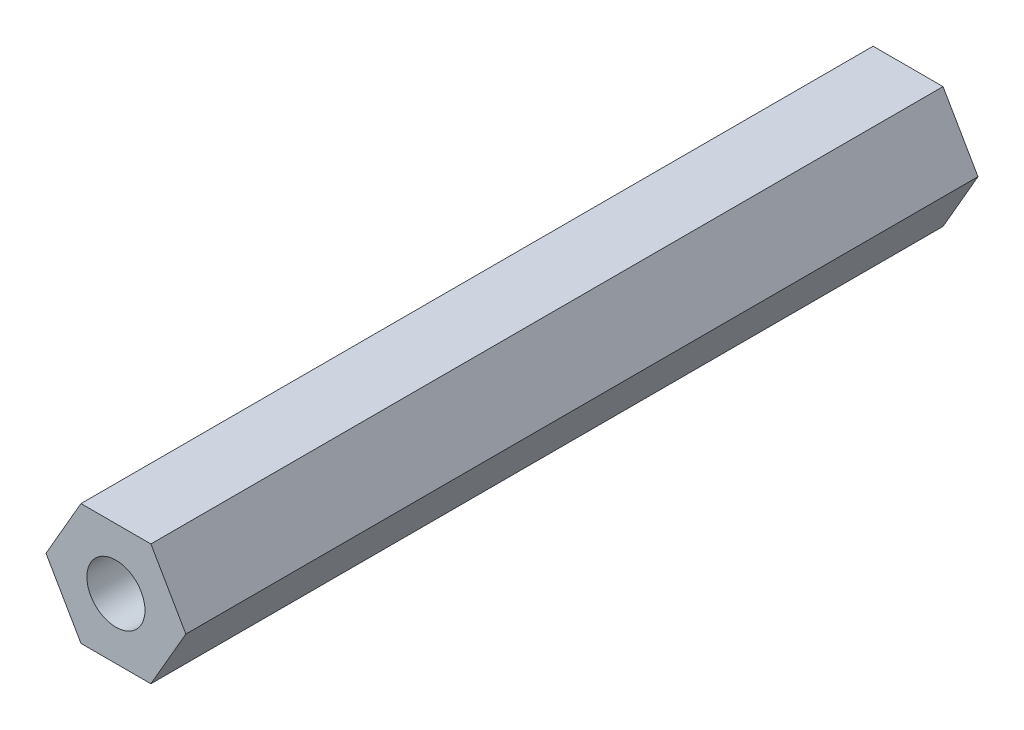
ISO-10303-21;
HEADER;
FILE_DESCRIPTION(('STEP AP214'),'2;1');
FILE_NAME('part.step','',(''),(''),'','','');
FILE_SCHEMA(('AUTOMOTIVE_DESIGN { 1 0 10303 214 1 1 1 1 }'));
ENDSEC;
DATA;
#1=APPLICATION_CONTEXT('core data for automotive mechanical design processes');
#2=APPLICATION_PROTOCOL_DEFINITION('international standard','automotive_design',2000,#1);
#3=PRODUCT_CONTEXT('',#1,'mechanical');
#4=PRODUCT('Part','Part','',(#3));
#5=PRODUCT_RELATED_PRODUCT_CATEGORY('part','',(#4));
#6=PRODUCT_DEFINITION_FORMATION('','',#4);
#7=PRODUCT_DEFINITION_CONTEXT('part definition',#1,'design');
#8=PRODUCT_DEFINITION('design','',#6,#7);
#9=PRODUCT_DEFINITION_SHAPE('','',#8);
#10=(LENGTH_UNIT() NAMED_UNIT(*) SI_UNIT(.MILLI.,.METRE.));
#11=(NAMED_UNIT(*) PLANE_ANGLE_UNIT() SI_UNIT($,.RADIAN.));
#12=(NAMED_UNIT(*) SI_UNIT($,.STERADIAN.) SOLID_ANGLE_UNIT());
#13=UNCERTAINTY_MEASURE_WITH_UNIT(LENGTH_MEASURE(1.E-05),#10,'distance_accuracy_value','');
#14=(GEOMETRIC_REPRESENTATION_CONTEXT(3) GLOBAL_UNCERTAINTY_ASSIGNED_CONTEXT((#13)) GLOBAL_UNIT_ASSIGNED_CONTEXT((#10,
#11,#12)) REPRESENTATION_CONTEXT('',''));
#15=CARTESIAN_POINT('',(0.,0.,0.));
#16=DIRECTION('',(0.,0.,1.));
#17=DIRECTION('',(1.,0.,0.));
#18=AXIS2_PLACEMENT_3D('',#15,#16,#17);
#19=CARTESIAN_POINT('',(3.97216985202463,0.,22.5));
#20=DIRECTION('',(-0.866025403784438,-0.5,0.));
#21=DIRECTION('',(0.5,-0.866025403784439,0.));
#22=AXIS2_PLACEMENT_3D('',#19,#20,#21);
#23=PLANE('',#22);
#24=DIRECTION('',(-0.5,0.866025403784438,0.));
#25=VECTOR('',#24,1.);
#26=CARTESIAN_POINT('',(3.97216985202463,0.,-22.5));
#27=LINE('',#26,#25);
#28=CARTESIAN_POINT('',(3.97216985202463,0.,-22.5));
#29=VERTEX_POINT('',#28);
#30=CARTESIAN_POINT('',(1.98608492601231,3.44,-22.5));
#31=VERTEX_POINT('',#30);
#32=EDGE_CURVE('E127',#29,#31,#27,.T.);
#33=ORIENTED_EDGE('',*,*,#32,.T.);
#34=DIRECTION('',(0.,0.,-1.));
#35=VECTOR('',#34,1.);
#36=CARTESIAN_POINT('',(1.98608492601231,3.44,22.5));
#37=LINE('',#36,#35);
#38=CARTESIAN_POINT('',(1.98608492601231,3.44,22.5));
#39=VERTEX_POINT('',#38);
#40=EDGE_CURVE('E11',#39,#31,#37,.T.);
#41=ORIENTED_EDGE('',*,*,#40,.F.);
#42=DIRECTION('',(-0.5,0.866025403784438,0.));
#43=VECTOR('',#42,1.);
#44=CARTESIAN_POINT('',(3.97216985202463,0.,22.5));
#45=LINE('',#44,#43);
#46=CARTESIAN_POINT('',(3.97216985202463,0.,22.5));
#47=VERTEX_POINT('',#46);
#48=EDGE_CURVE('E138',#47,#39,#45,.T.);
#49=ORIENTED_EDGE('',*,*,#48,.F.);
#50=DIRECTION('',(0.,0.,-1.));
#51=VECTOR('',#50,1.);
#52=CARTESIAN_POINT('',(3.97216985202463,0.,22.5));
#53=LINE('',#52,#51);
#54=EDGE_CURVE('E123',#47,#29,#53,.T.);
#55=ORIENTED_EDGE('',*,*,#54,.T.);
#56=EDGE_LOOP('',(#33,#41,#49,#55));
#57=FACE_BOUND('',#56,.T.);
#58=ADVANCED_FACE('F40',(#57),#23,.F.);
#59=CARTESIAN_POINT('',(1.98608492601231,3.44,22.5));
#60=DIRECTION('',(0.,-1.,0.));
#61=DIRECTION('',(0.,0.,-1.));
#62=AXIS2_PLACEMENT_3D('',#59,#60,#61);
#63=PLANE('',#62);
#64=DIRECTION('',(-1.,0.,0.));
#65=VECTOR('',#64,1.);
#66=CARTESIAN_POINT('',(1.98608492601231,3.44,-22.5));
#67=LINE('',#66,#65);
#68=CARTESIAN_POINT('',(-1.98608492601231,3.44,-22.5));
#69=VERTEX_POINT('',#68);
#70=EDGE_CURVE('E130',#31,#69,#67,.T.);
#71=ORIENTED_EDGE('',*,*,#70,.T.);
#72=DIRECTION('',(0.,0.,-1.));
#73=VECTOR('',#72,1.);
#74=CARTESIAN_POINT('',(-1.98608492601231,3.44,22.5));
#75=LINE('',#74,#73);
#76=CARTESIAN_POINT('',(-1.98608492601231,3.44,22.5));
#77=VERTEX_POINT('',#76);
#78=EDGE_CURVE('E48',#77,#69,#75,.T.);
#79=ORIENTED_EDGE('',*,*,#78,.F.);
#80=DIRECTION('',(-1.,0.,0.));
#81=VECTOR('',#80,1.);
#82=CARTESIAN_POINT('',(1.98608492601231,3.44,22.5));
#83=LINE('',#82,#81);
#84=EDGE_CURVE('E94',#39,#77,#83,.T.);
#85=ORIENTED_EDGE('',*,*,#84,.F.);
#86=ORIENTED_EDGE('',*,*,#40,.T.);
#87=EDGE_LOOP('',(#71,#79,#85,#86));
#88=FACE_BOUND('',#87,.T.);
#89=ADVANCED_FACE('F163',(#88),#63,.F.);
#90=CARTESIAN_POINT('',(-1.98608492601231,3.44,22.5));
#91=DIRECTION('',(0.866025403784439,-0.5,0.));
#92=DIRECTION('',(0.5,0.866025403784439,0.));
#93=AXIS2_PLACEMENT_3D('',#90,#91,#92);
#94=PLANE('',#93);
#95=DIRECTION('',(-0.5,-0.866025403784439,0.));
#96=VECTOR('',#95,1.);
#97=CARTESIAN_POINT('',(-1.98608492601231,3.44,-22.5));
#98=LINE('',#97,#96);
#99=CARTESIAN_POINT('',(-3.97216985202463,0.,-22.5));
#100=VERTEX_POINT('',#99);
#101=EDGE_CURVE('E133',#69,#100,#98,.T.);
#102=ORIENTED_EDGE('',*,*,#101,.T.);
#103=DIRECTION('',(0.,0.,-1.));
#104=VECTOR('',#103,1.);
#105=CARTESIAN_POINT('',(-3.97216985202463,0.,22.5));
#106=LINE('',#105,#104);
#107=CARTESIAN_POINT('',(-3.97216985202463,0.,22.5));
#108=VERTEX_POINT('',#107);
#109=EDGE_CURVE('E118',#108,#100,#106,.T.);
#110=ORIENTED_EDGE('',*,*,#109,.F.);
#111=DIRECTION('',(-0.5,-0.866025403784439,0.));
#112=VECTOR('',#111,1.);
#113=CARTESIAN_POINT('',(-1.98608492601231,3.44,22.5));
#114=LINE('',#113,#112);
#115=EDGE_CURVE('E109',#77,#108,#114,.T.);
#116=ORIENTED_EDGE('',*,*,#115,.F.);
#117=ORIENTED_EDGE('',*,*,#78,.T.);
#118=EDGE_LOOP('',(#102,#110,#116,#117));
#119=FACE_BOUND('',#118,.T.);
#120=ADVANCED_FACE('F144',(#119),#94,.F.);
#121=CARTESIAN_POINT('',(-3.97216985202463,0.,22.5));
#122=DIRECTION('',(0.866025403784439,0.5,0.));
#123=DIRECTION('',(-0.5,0.866025403784439,0.));
#124=AXIS2_PLACEMENT_3D('',#121,#122,#123);
#125=PLANE('',#124);
#126=DIRECTION('',(0.5,-0.866025403784438,0.));
#127=VECTOR('',#126,1.);
#128=CARTESIAN_POINT('',(-3.97216985202463,0.,-22.5));
#129=LINE('',#128,#127);
#130=CARTESIAN_POINT('',(-1.98608492601231,-3.44,-22.5));
#131=VERTEX_POINT('',#130);
#132=EDGE_CURVE('E117',#100,#131,#129,.T.);
#133=ORIENTED_EDGE('',*,*,#132,.T.);
#134=DIRECTION('',(0.,0.,-1.));
#135=VECTOR('',#134,1.);
#136=CARTESIAN_POINT('',(-1.98608492601231,-3.44,22.5));
#137=LINE('',#136,#135);
#138=CARTESIAN_POINT('',(-1.98608492601231,-3.44,22.5));
#139=VERTEX_POINT('',#138);
#140=EDGE_CURVE('E114',#139,#131,#137,.T.);
#141=ORIENTED_EDGE('',*,*,#140,.F.);
#142=DIRECTION('',(0.5,-0.866025403784438,0.));
#143=VECTOR('',#142,1.);
#144=CARTESIAN_POINT('',(-3.97216985202463,0.,22.5));
#145=LINE('',#144,#143);
#146=EDGE_CURVE('E103',#108,#139,#145,.T.);
#147=ORIENTED_EDGE('',*,*,#146,.F.);
#148=ORIENTED_EDGE('',*,*,#109,.T.);
#149=EDGE_LOOP('',(#133,#141,#147,#148));
#150=FACE_BOUND('',#149,.T.);
#151=ADVANCED_FACE('F115',(#150),#125,.F.);
#152=CARTESIAN_POINT('',(-1.98608492601231,-3.44,22.5));
#153=DIRECTION('',(0.,1.,0.));
#154=DIRECTION('',(-1.,0.,0.));
#155=AXIS2_PLACEMENT_3D('',#152,#153,#154);
#156=PLANE('',#155);
#157=DIRECTION('',(1.,0.,0.));
#158=VECTOR('',#157,1.);
#159=CARTESIAN_POINT('',(-1.98608492601231,-3.44,-22.5));
#160=LINE('',#159,#158);
#161=CARTESIAN_POINT('',(1.98608492601231,-3.44,-22.5));
#162=VERTEX_POINT('',#161);
#163=EDGE_CURVE('E80',#131,#162,#160,.T.);
#164=ORIENTED_EDGE('',*,*,#163,.T.);
#165=DIRECTION('',(0.,0.,-1.));
#166=VECTOR('',#165,1.);
#167=CARTESIAN_POINT('',(1.98608492601231,-3.44,22.5));
#168=LINE('',#167,#166);
#169=CARTESIAN_POINT('',(1.98608492601231,-3.44,22.5));
#170=VERTEX_POINT('',#169);
#171=EDGE_CURVE('E119',#170,#162,#168,.T.);
#172=ORIENTED_EDGE('',*,*,#171,.F.);
#173=DIRECTION('',(1.,0.,0.));
#174=VECTOR('',#173,1.);
#175=CARTESIAN_POINT('',(-1.98608492601231,-3.44,22.5));
#176=LINE('',#175,#174);
#177=EDGE_CURVE('E107',#139,#170,#176,.T.);
#178=ORIENTED_EDGE('',*,*,#177,.F.);
#179=ORIENTED_EDGE('',*,*,#140,.T.);
#180=EDGE_LOOP('',(#164,#172,#178,#179));
#181=FACE_BOUND('',#180,.T.);
#182=ADVANCED_FACE('F121',(#181),#156,.F.);
#183=CARTESIAN_POINT('',(1.98608492601231,-3.44,22.5));
#184=DIRECTION('',(-0.866025403784439,0.5,0.));
#185=DIRECTION('',(-0.5,-0.866025403784439,0.));
#186=AXIS2_PLACEMENT_3D('',#183,#184,#185);
#187=PLANE('',#186);
#188=DIRECTION('',(0.5,0.866025403784438,0.));
#189=VECTOR('',#188,1.);
#190=CARTESIAN_POINT('',(1.98608492601231,-3.44,-22.5));
#191=LINE('',#190,#189);
#192=EDGE_CURVE('E86',#162,#29,#191,.T.);
#193=ORIENTED_EDGE('',*,*,#192,.T.);
#194=ORIENTED_EDGE('',*,*,#54,.F.);
#195=DIRECTION('',(0.5,0.866025403784438,0.));
#196=VECTOR('',#195,1.);
#197=CARTESIAN_POINT('',(1.98608492601231,-3.44,22.5));
#198=LINE('',#197,#196);
#199=EDGE_CURVE('E56',#170,#47,#198,.T.);
#200=ORIENTED_EDGE('',*,*,#199,.F.);
#201=ORIENTED_EDGE('',*,*,#171,.T.);
#202=EDGE_LOOP('',(#193,#194,#200,#201));
#203=FACE_BOUND('',#202,.T.);
#204=ADVANCED_FACE('F151',(#203),#187,.F.);
#205=CARTESIAN_POINT('',(0.,0.,22.5));
#206=DIRECTION('',(0.,0.,1.));
#207=DIRECTION('',(1.,0.,0.));
#208=AXIS2_PLACEMENT_3D('',#205,#206,#207);
#209=PLANE('',#208);
#210=CARTESIAN_POINT('',(0.,0.,22.5));
#211=DIRECTION('',(0.,0.,1.));
#212=DIRECTION('',(1.,0.,0.));
#213=AXIS2_PLACEMENT_3D('',#210,#211,#212);
#214=CIRCLE('',#213,1.65);
#215=CARTESIAN_POINT('',(1.65,0.,22.5));
#216=VERTEX_POINT('',#215);
#217=EDGE_CURVE('E269',#216,#216,#214,.T.);
#218=ORIENTED_EDGE('',*,*,#217,.F.);
#219=EDGE_LOOP('',(#218));
#220=FACE_BOUND('',#219,.T.);
#221=ORIENTED_EDGE('',*,*,#48,.T.);
#222=ORIENTED_EDGE('',*,*,#84,.T.);
#223=ORIENTED_EDGE('',*,*,#115,.T.);
#224=ORIENTED_EDGE('',*,*,#146,.T.);
#225=ORIENTED_EDGE('',*,*,#177,.T.);
#226=ORIENTED_EDGE('',*,*,#199,.T.);
#227=EDGE_LOOP('',(#221,#222,#223,#224,#225,#226));
#228=FACE_BOUND('',#227,.T.);
#229=ADVANCED_FACE('F105',(#220,#228),#209,.T.);
#230=CARTESIAN_POINT('',(0.,0.,-22.5));
#231=DIRECTION('',(0.,0.,1.));
#232=DIRECTION('',(1.,0.,0.));
#233=AXIS2_PLACEMENT_3D('',#230,#231,#232);
#234=PLANE('',#233);
#235=CARTESIAN_POINT('',(0.,0.,-22.5));
#236=DIRECTION('',(0.,0.,-1.));
#237=DIRECTION('',(-1.,0.,0.));
#238=AXIS2_PLACEMENT_3D('',#235,#236,#237);
#239=CIRCLE('',#238,1.65);
#240=CARTESIAN_POINT('',(-1.65,0.,-22.5));
#241=VERTEX_POINT('',#240);
#242=EDGE_CURVE('E267',#241,#241,#239,.T.);
#243=ORIENTED_EDGE('',*,*,#242,.F.);
#244=EDGE_LOOP('',(#243));
#245=FACE_BOUND('',#244,.T.);
#246=ORIENTED_EDGE('',*,*,#32,.F.);
#247=ORIENTED_EDGE('',*,*,#192,.F.);
#248=ORIENTED_EDGE('',*,*,#163,.F.);
#249=ORIENTED_EDGE('',*,*,#132,.F.);
#250=ORIENTED_EDGE('',*,*,#101,.F.);
#251=ORIENTED_EDGE('',*,*,#70,.F.);
#252=EDGE_LOOP('',(#246,#247,#248,#249,#250,#251));
#253=FACE_BOUND('',#252,.T.);
#254=ADVANCED_FACE('F147',(#245,#253),#234,.F.);
#255=CARTESIAN_POINT('',(0.,0.,9.3));
#256=DIRECTION('',(0.,0.,1.));
#257=DIRECTION('',(1.,0.,0.));
#258=AXIS2_PLACEMENT_3D('',#255,#256,#257);
#259=CONICAL_SURFACE('',#258,1.65,1.02974425867665);
#260=CARTESIAN_POINT('',(0.,0.,8.30857997860452));
#261=VERTEX_POINT('',#260);
#262=VERTEX_LOOP('',#261);
#263=FACE_BOUND('',#262,.T.);
#264=CARTESIAN_POINT('',(0.,0.,9.3));
#265=DIRECTION('',(0.,0.,1.));
#266=DIRECTION('',(1.,0.,0.));
#267=AXIS2_PLACEMENT_3D('',#264,#265,#266);
#268=CIRCLE('',#267,1.65);
#269=CARTESIAN_POINT('',(1.65,0.,9.3));
#270=VERTEX_POINT('',#269);
#271=EDGE_CURVE('E131',#270,#270,#268,.T.);
#272=ORIENTED_EDGE('',*,*,#271,.T.);
#273=EDGE_LOOP('',(#272));
#274=FACE_BOUND('',#273,.T.);
#275=ADVANCED_FACE('F200',(#263,#274),#259,.F.);
#276=CARTESIAN_POINT('',(0.,0.,22.5));
#277=DIRECTION('',(0.,0.,1.));
#278=DIRECTION('',(1.,0.,0.));
#279=AXIS2_PLACEMENT_3D('',#276,#277,#278);
#280=CYLINDRICAL_SURFACE('',#279,1.65);
#281=ORIENTED_EDGE('',*,*,#271,.F.);
#282=EDGE_LOOP('',(#281));
#283=FACE_BOUND('',#282,.T.);
#284=ORIENTED_EDGE('',*,*,#217,.T.);
#285=EDGE_LOOP('',(#284));
#286=FACE_BOUND('',#285,.T.);
#287=ADVANCED_FACE('F205',(#283,#286),#280,.F.);
#288=CARTESIAN_POINT('',(0.,0.,-9.3));
#289=DIRECTION('',(0.,0.,-1.));
#290=DIRECTION('',(-1.,0.,0.));
#291=AXIS2_PLACEMENT_3D('',#288,#289,#290);
#292=CONICAL_SURFACE('',#291,1.65,1.02974425867665);
#293=CARTESIAN_POINT('',(0.,0.,-8.30857997860452));
#294=VERTEX_POINT('',#293);
#295=VERTEX_LOOP('',#294);
#296=FACE_BOUND('',#295,.T.);
#297=CARTESIAN_POINT('',(0.,0.,-9.3));
#298=DIRECTION('',(0.,0.,-1.));
#299=DIRECTION('',(-1.,0.,0.));
#300=AXIS2_PLACEMENT_3D('',#297,#298,#299);
#301=CIRCLE('',#300,1.65);
#302=CARTESIAN_POINT('',(-1.65,0.,-9.3));
#303=VERTEX_POINT('',#302);
#304=EDGE_CURVE('E264',#303,#303,#301,.T.);
#305=ORIENTED_EDGE('',*,*,#304,.T.);
#306=EDGE_LOOP('',(#305));
#307=FACE_BOUND('',#306,.T.);
#308=ADVANCED_FACE('F216',(#296,#307),#292,.F.);
#309=CARTESIAN_POINT('',(0.,0.,-22.5));
#310=DIRECTION('',(0.,0.,-1.));
#311=DIRECTION('',(-1.,0.,0.));
#312=AXIS2_PLACEMENT_3D('',#309,#310,#311);
#313=CYLINDRICAL_SURFACE('',#312,1.65);
#314=ORIENTED_EDGE('',*,*,#304,.F.);
#315=EDGE_LOOP('',(#314));
#316=FACE_BOUND('',#315,.T.);
#317=ORIENTED_EDGE('',*,*,#242,.T.);
#318=EDGE_LOOP('',(#317));
#319=FACE_BOUND('',#318,.T.);
#320=ADVANCED_FACE('F237',(#316,#319),#313,.F.);
#321=CLOSED_SHELL('',(#58,#89,#120,#151,#182,#204,#229,#254,#275,#287,#308,#320));
#322=MANIFOLD_SOLID_BREP('B2',#321);
#323=ADVANCED_BREP_SHAPE_REPRESENTATION('',(#18,#322),#14);
#324=SHAPE_DEFINITION_REPRESENTATION(#9,#323);
ENDSEC;
END-ISO-10303-21;
